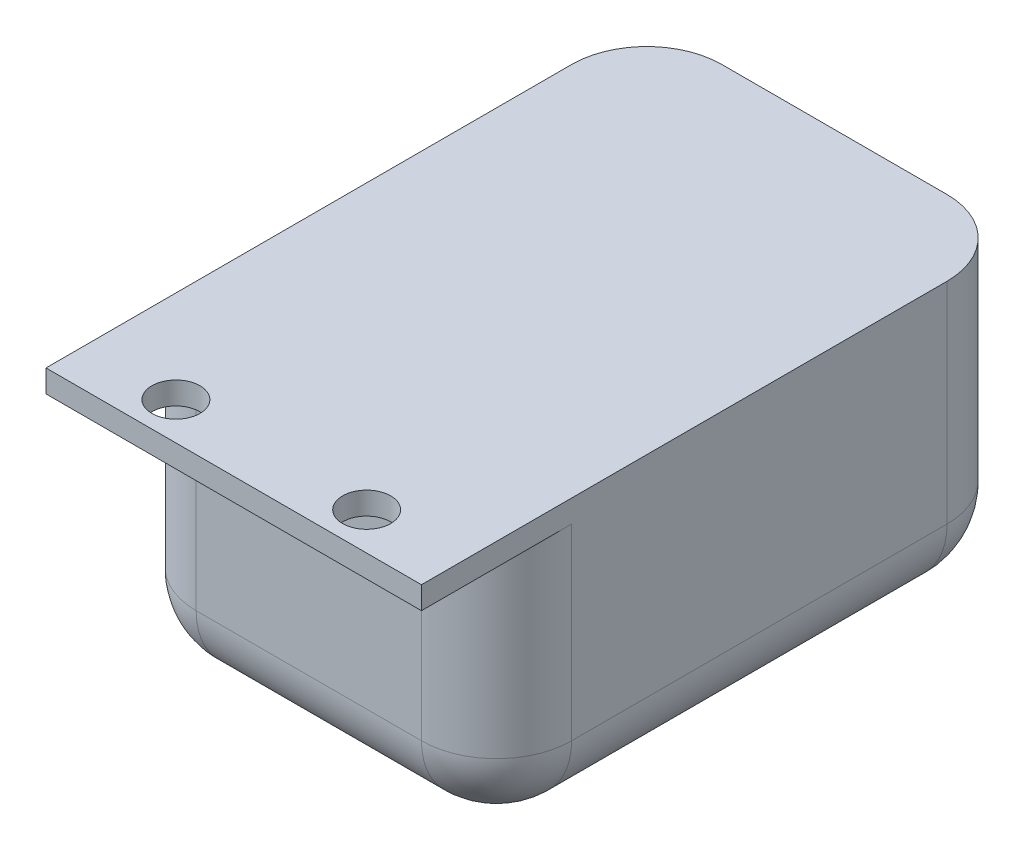
ISO-10303-21;
HEADER;
FILE_DESCRIPTION(('STEP AP214'),'2;1');
FILE_NAME('part.step','',(''),(''),'','','');
FILE_SCHEMA(('AUTOMOTIVE_DESIGN { 1 0 10303 214 1 1 1 1 }'));
ENDSEC;
DATA;
#1=APPLICATION_CONTEXT('core data for automotive mechanical design processes');
#2=APPLICATION_PROTOCOL_DEFINITION('international standard','automotive_design',2000,#1);
#3=PRODUCT_CONTEXT('',#1,'mechanical');
#4=PRODUCT('Part','Part','',(#3));
#5=PRODUCT_RELATED_PRODUCT_CATEGORY('part','',(#4));
#6=PRODUCT_DEFINITION_FORMATION('','',#4);
#7=PRODUCT_DEFINITION_CONTEXT('part definition',#1,'design');
#8=PRODUCT_DEFINITION('design','',#6,#7);
#9=PRODUCT_DEFINITION_SHAPE('','',#8);
#10=(LENGTH_UNIT() NAMED_UNIT(*) SI_UNIT(.MILLI.,.METRE.));
#11=(NAMED_UNIT(*) PLANE_ANGLE_UNIT() SI_UNIT($,.RADIAN.));
#12=(NAMED_UNIT(*) SI_UNIT($,.STERADIAN.) SOLID_ANGLE_UNIT());
#13=UNCERTAINTY_MEASURE_WITH_UNIT(LENGTH_MEASURE(1.E-05),#10,'distance_accuracy_value','');
#14=(GEOMETRIC_REPRESENTATION_CONTEXT(3) GLOBAL_UNCERTAINTY_ASSIGNED_CONTEXT((#13)) GLOBAL_UNIT_ASSIGNED_CONTEXT((#10,
#11,#12)) REPRESENTATION_CONTEXT('',''));
#15=CARTESIAN_POINT('',(0.,0.,0.));
#16=DIRECTION('',(0.,0.,1.));
#17=DIRECTION('',(1.,0.,0.));
#18=AXIS2_PLACEMENT_3D('',#15,#16,#17);
#19=CARTESIAN_POINT('',(50.,17.5,35.));
#20=DIRECTION('',(0.,0.,-1.));
#21=DIRECTION('',(-1.,0.,0.));
#22=AXIS2_PLACEMENT_3D('',#19,#20,#21);
#23=PLANE('',#22);
#24=DIRECTION('',(-1.,0.,0.));
#25=VECTOR('',#24,1.);
#26=CARTESIAN_POINT('',(50.,-7.5,35.));
#27=LINE('',#26,#25);
#28=CARTESIAN_POINT('',(10.,-7.5,35.));
#29=VERTEX_POINT('',#28);
#30=CARTESIAN_POINT('',(40.,-7.5,35.));
#31=VERTEX_POINT('',#30);
#32=EDGE_CURVE('E282',#29,#31,#27,.F.);
#33=ORIENTED_EDGE('',*,*,#32,.T.);
#34=DIRECTION('',(0.,-1.,0.));
#35=VECTOR('',#34,1.);
#36=CARTESIAN_POINT('',(40.,17.5,35.));
#37=LINE('',#36,#35);
#38=CARTESIAN_POINT('',(40.,17.5,35.));
#39=VERTEX_POINT('',#38);
#40=EDGE_CURVE('E284',#31,#39,#37,.F.);
#41=ORIENTED_EDGE('',*,*,#40,.T.);
#42=DIRECTION('',(1.,0.,0.));
#43=VECTOR('',#42,1.);
#44=CARTESIAN_POINT('',(50.,17.5,35.));
#45=LINE('',#44,#43);
#46=CARTESIAN_POINT('',(10.,17.5,35.));
#47=VERTEX_POINT('',#46);
#48=EDGE_CURVE('E207',#47,#39,#45,.T.);
#49=ORIENTED_EDGE('',*,*,#48,.F.);
#50=DIRECTION('',(0.,-1.,0.));
#51=VECTOR('',#50,1.);
#52=CARTESIAN_POINT('',(10.,17.5,35.));
#53=LINE('',#52,#51);
#54=EDGE_CURVE('E280',#47,#29,#53,.T.);
#55=ORIENTED_EDGE('',*,*,#54,.T.);
#56=EDGE_LOOP('',(#33,#41,#49,#55));
#57=FACE_BOUND('',#56,.T.);
#58=ADVANCED_FACE('F35',(#57),#23,.F.);
#59=CARTESIAN_POINT('',(50.,-14.5,35.));
#60=DIRECTION('',(0.,1.,0.));
#61=DIRECTION('',(0.,0.,1.));
#62=AXIS2_PLACEMENT_3D('',#59,#60,#61);
#63=PLANE('',#62);
#64=DIRECTION('',(-1.,0.,0.));
#65=VECTOR('',#64,1.);
#66=CARTESIAN_POINT('',(3.,-14.5,-22.));
#67=LINE('',#66,#65);
#68=CARTESIAN_POINT('',(37.,-14.5,-22.));
#69=VERTEX_POINT('',#68);
#70=CARTESIAN_POINT('',(13.,-14.5,-22.));
#71=VERTEX_POINT('',#70);
#72=EDGE_CURVE('E59',#69,#71,#67,.T.);
#73=ORIENTED_EDGE('',*,*,#72,.T.);
#74=DIRECTION('',(0.,0.,-1.));
#75=VECTOR('',#74,1.);
#76=CARTESIAN_POINT('',(13.,-14.5,32.));
#77=LINE('',#76,#75);
#78=CARTESIAN_POINT('',(13.,-14.5,22.));
#79=VERTEX_POINT('',#78);
#80=EDGE_CURVE('E11',#71,#79,#77,.F.);
#81=ORIENTED_EDGE('',*,*,#80,.T.);
#82=DIRECTION('',(-1.,0.,0.));
#83=VECTOR('',#82,1.);
#84=CARTESIAN_POINT('',(47.,-14.5,22.));
#85=LINE('',#84,#83);
#86=CARTESIAN_POINT('',(37.,-14.5,22.));
#87=VERTEX_POINT('',#86);
#88=EDGE_CURVE('E44',#79,#87,#85,.F.);
#89=ORIENTED_EDGE('',*,*,#88,.T.);
#90=DIRECTION('',(0.,0.,-1.));
#91=VECTOR('',#90,1.);
#92=CARTESIAN_POINT('',(37.,-14.5,35.));
#93=LINE('',#92,#91);
#94=EDGE_CURVE('E360',#87,#69,#93,.T.);
#95=ORIENTED_EDGE('',*,*,#94,.T.);
#96=EDGE_LOOP('',(#73,#81,#89,#95));
#97=FACE_BOUND('',#96,.T.);
#98=CARTESIAN_POINT('',(25.,-14.5,0.));
#99=DIRECTION('',(0.,1.,0.));
#100=DIRECTION('',(0.,0.,1.));
#101=AXIS2_PLACEMENT_3D('',#98,#99,#100);
#102=CIRCLE('',#101,4.5);
#103=CARTESIAN_POINT('',(25.,-14.5,4.5));
#104=VERTEX_POINT('',#103);
#105=EDGE_CURVE('E213',#104,#104,#102,.F.);
#106=ORIENTED_EDGE('',*,*,#105,.T.);
#107=EDGE_LOOP('',(#106));
#108=FACE_BOUND('',#107,.T.);
#109=ADVANCED_FACE('F435',(#97,#108),#63,.T.);
#110=CARTESIAN_POINT('',(47.,0.,0.));
#111=DIRECTION('',(1.,0.,0.));
#112=DIRECTION('',(0.,0.,-1.));
#113=AXIS2_PLACEMENT_3D('',#110,#111,#112);
#114=PLANE('',#113);
#115=DIRECTION('',(0.,0.,1.));
#116=VECTOR('',#115,1.);
#117=CARTESIAN_POINT('',(47.,17.5,35.));
#118=LINE('',#117,#116);
#119=CARTESIAN_POINT('',(47.,17.5,-22.));
#120=VERTEX_POINT('',#119);
#121=CARTESIAN_POINT('',(47.,17.5,22.));
#122=VERTEX_POINT('',#121);
#123=EDGE_CURVE('E242',#120,#122,#118,.T.);
#124=ORIENTED_EDGE('',*,*,#123,.F.);
#125=DIRECTION('',(0.,1.,0.));
#126=VECTOR('',#125,1.);
#127=CARTESIAN_POINT('',(47.,0.,-22.));
#128=LINE('',#127,#126);
#129=CARTESIAN_POINT('',(47.,-4.5,-22.));
#130=VERTEX_POINT('',#129);
#131=EDGE_CURVE('E352',#120,#130,#128,.F.);
#132=ORIENTED_EDGE('',*,*,#131,.T.);
#133=DIRECTION('',(0.,0.,-1.));
#134=VECTOR('',#133,1.);
#135=CARTESIAN_POINT('',(47.,-4.5,0.));
#136=LINE('',#135,#134);
#137=CARTESIAN_POINT('',(47.,-4.5,22.));
#138=VERTEX_POINT('',#137);
#139=EDGE_CURVE('E348',#130,#138,#136,.F.);
#140=ORIENTED_EDGE('',*,*,#139,.T.);
#141=DIRECTION('',(0.,-1.,0.));
#142=VECTOR('',#141,1.);
#143=CARTESIAN_POINT('',(47.,0.,22.));
#144=LINE('',#143,#142);
#145=EDGE_CURVE('E350',#138,#122,#144,.F.);
#146=ORIENTED_EDGE('',*,*,#145,.T.);
#147=EDGE_LOOP('',(#124,#132,#140,#146));
#148=FACE_BOUND('',#147,.T.);
#149=ADVANCED_FACE('F408',(#148),#114,.F.);
#150=CARTESIAN_POINT('',(3.,0.,0.));
#151=DIRECTION('',(1.,0.,0.));
#152=DIRECTION('',(0.,0.,-1.));
#153=AXIS2_PLACEMENT_3D('',#150,#151,#152);
#154=PLANE('',#153);
#155=DIRECTION('',(0.,0.,-1.));
#156=VECTOR('',#155,1.);
#157=CARTESIAN_POINT('',(3.,-4.5,-32.));
#158=LINE('',#157,#156);
#159=CARTESIAN_POINT('',(3.,-4.5,22.));
#160=VERTEX_POINT('',#159);
#161=CARTESIAN_POINT('',(3.,-4.5,-22.));
#162=VERTEX_POINT('',#161);
#163=EDGE_CURVE('E290',#160,#162,#158,.T.);
#164=ORIENTED_EDGE('',*,*,#163,.T.);
#165=DIRECTION('',(0.,1.,0.));
#166=VECTOR('',#165,1.);
#167=CARTESIAN_POINT('',(3.,17.5,-22.));
#168=LINE('',#167,#166);
#169=CARTESIAN_POINT('',(3.,17.5,-22.));
#170=VERTEX_POINT('',#169);
#171=EDGE_CURVE('E331',#162,#170,#168,.T.);
#172=ORIENTED_EDGE('',*,*,#171,.T.);
#173=DIRECTION('',(0.,0.,1.));
#174=VECTOR('',#173,1.);
#175=CARTESIAN_POINT('',(3.,17.5,35.));
#176=LINE('',#175,#174);
#177=CARTESIAN_POINT('',(3.,17.5,22.));
#178=VERTEX_POINT('',#177);
#179=EDGE_CURVE('E234',#170,#178,#176,.T.);
#180=ORIENTED_EDGE('',*,*,#179,.T.);
#181=DIRECTION('',(0.,-1.,0.));
#182=VECTOR('',#181,1.);
#183=CARTESIAN_POINT('',(3.,-14.5,22.));
#184=LINE('',#183,#182);
#185=EDGE_CURVE('E329',#178,#160,#184,.T.);
#186=ORIENTED_EDGE('',*,*,#185,.T.);
#187=EDGE_LOOP('',(#164,#172,#180,#186));
#188=FACE_BOUND('',#187,.T.);
#189=ADVANCED_FACE('F450',(#188),#154,.T.);
#190=CARTESIAN_POINT('',(50.,17.5,32.));
#191=DIRECTION('',(0.,0.,-1.));
#192=DIRECTION('',(-1.,0.,0.));
#193=AXIS2_PLACEMENT_3D('',#190,#191,#192);
#194=PLANE('',#193);
#195=DIRECTION('',(-1.,0.,0.));
#196=VECTOR('',#195,1.);
#197=CARTESIAN_POINT('',(3.,-4.5,32.));
#198=LINE('',#197,#196);
#199=CARTESIAN_POINT('',(37.,-4.5,32.));
#200=VERTEX_POINT('',#199);
#201=CARTESIAN_POINT('',(13.,-4.5,32.));
#202=VERTEX_POINT('',#201);
#203=EDGE_CURVE('E354',#200,#202,#198,.T.);
#204=ORIENTED_EDGE('',*,*,#203,.T.);
#205=DIRECTION('',(0.,-1.,0.));
#206=VECTOR('',#205,1.);
#207=CARTESIAN_POINT('',(13.,17.5,32.));
#208=LINE('',#207,#206);
#209=CARTESIAN_POINT('',(13.,17.5,32.));
#210=VERTEX_POINT('',#209);
#211=EDGE_CURVE('E358',#202,#210,#208,.F.);
#212=ORIENTED_EDGE('',*,*,#211,.T.);
#213=DIRECTION('',(-1.,0.,0.));
#214=VECTOR('',#213,1.);
#215=CARTESIAN_POINT('',(50.,17.5,32.));
#216=LINE('',#215,#214);
#217=CARTESIAN_POINT('',(37.,17.5,32.));
#218=VERTEX_POINT('',#217);
#219=EDGE_CURVE('E239',#218,#210,#216,.T.);
#220=ORIENTED_EDGE('',*,*,#219,.F.);
#221=DIRECTION('',(0.,-1.,0.));
#222=VECTOR('',#221,1.);
#223=CARTESIAN_POINT('',(37.,17.5,32.));
#224=LINE('',#223,#222);
#225=EDGE_CURVE('E356',#218,#200,#224,.T.);
#226=ORIENTED_EDGE('',*,*,#225,.T.);
#227=EDGE_LOOP('',(#204,#212,#220,#226));
#228=FACE_BOUND('',#227,.T.);
#229=ADVANCED_FACE('F443',(#228),#194,.T.);
#230=CARTESIAN_POINT('',(50.,17.5,-32.));
#231=DIRECTION('',(0.,0.,1.));
#232=DIRECTION('',(1.,0.,0.));
#233=AXIS2_PLACEMENT_3D('',#230,#231,#232);
#234=PLANE('',#233);
#235=DIRECTION('',(-1.,0.,0.));
#236=VECTOR('',#235,1.);
#237=CARTESIAN_POINT('',(50.,17.5,-32.));
#238=LINE('',#237,#236);
#239=CARTESIAN_POINT('',(37.,17.5,-32.));
#240=VERTEX_POINT('',#239);
#241=CARTESIAN_POINT('',(13.,17.5,-32.));
#242=VERTEX_POINT('',#241);
#243=EDGE_CURVE('E235',#240,#242,#238,.T.);
#244=ORIENTED_EDGE('',*,*,#243,.T.);
#245=DIRECTION('',(0.,1.,0.));
#246=VECTOR('',#245,1.);
#247=CARTESIAN_POINT('',(13.,-14.5,-32.));
#248=LINE('',#247,#246);
#249=CARTESIAN_POINT('',(13.,-4.5,-32.));
#250=VERTEX_POINT('',#249);
#251=EDGE_CURVE('E346',#242,#250,#248,.F.);
#252=ORIENTED_EDGE('',*,*,#251,.T.);
#253=DIRECTION('',(-1.,0.,0.));
#254=VECTOR('',#253,1.);
#255=CARTESIAN_POINT('',(47.,-4.5,-32.));
#256=LINE('',#255,#254);
#257=CARTESIAN_POINT('',(37.,-4.5,-32.));
#258=VERTEX_POINT('',#257);
#259=EDGE_CURVE('E342',#250,#258,#256,.F.);
#260=ORIENTED_EDGE('',*,*,#259,.T.);
#261=DIRECTION('',(0.,1.,0.));
#262=VECTOR('',#261,1.);
#263=CARTESIAN_POINT('',(37.,17.5,-32.));
#264=LINE('',#263,#262);
#265=EDGE_CURVE('E344',#258,#240,#264,.T.);
#266=ORIENTED_EDGE('',*,*,#265,.T.);
#267=EDGE_LOOP('',(#244,#252,#260,#266));
#268=FACE_BOUND('',#267,.T.);
#269=ADVANCED_FACE('F455',(#268),#234,.T.);
#270=CARTESIAN_POINT('',(0.,17.5,0.));
#271=DIRECTION('',(0.,-1.,0.));
#272=DIRECTION('',(0.,0.,-1.));
#273=AXIS2_PLACEMENT_3D('',#270,#271,#272);
#274=PLANE('',#273);
#275=ORIENTED_EDGE('',*,*,#179,.F.);
#276=CARTESIAN_POINT('',(13.,17.5,-22.));
#277=DIRECTION('',(0.,-1.,0.));
#278=DIRECTION('',(0.,0.,-1.));
#279=AXIS2_PLACEMENT_3D('',#276,#277,#278);
#280=CIRCLE('',#279,10.);
#281=EDGE_CURVE('E340',#170,#242,#280,.T.);
#282=ORIENTED_EDGE('',*,*,#281,.T.);
#283=ORIENTED_EDGE('',*,*,#243,.F.);
#284=CARTESIAN_POINT('',(37.,17.5,-22.));
#285=DIRECTION('',(0.,-1.,0.));
#286=DIRECTION('',(0.,0.,-1.));
#287=AXIS2_PLACEMENT_3D('',#284,#285,#286);
#288=CIRCLE('',#287,10.);
#289=EDGE_CURVE('E338',#240,#120,#288,.T.);
#290=ORIENTED_EDGE('',*,*,#289,.T.);
#291=ORIENTED_EDGE('',*,*,#123,.T.);
#292=CARTESIAN_POINT('',(37.,17.5,22.));
#293=DIRECTION('',(0.,-1.,0.));
#294=DIRECTION('',(0.,0.,-1.));
#295=AXIS2_PLACEMENT_3D('',#292,#293,#294);
#296=CIRCLE('',#295,10.);
#297=EDGE_CURVE('E334',#122,#218,#296,.T.);
#298=ORIENTED_EDGE('',*,*,#297,.T.);
#299=ORIENTED_EDGE('',*,*,#219,.T.);
#300=CARTESIAN_POINT('',(13.,17.5,22.));
#301=DIRECTION('',(0.,-1.,0.));
#302=DIRECTION('',(0.,0.,-1.));
#303=AXIS2_PLACEMENT_3D('',#300,#301,#302);
#304=CIRCLE('',#303,10.);
#305=EDGE_CURVE('E336',#210,#178,#304,.T.);
#306=ORIENTED_EDGE('',*,*,#305,.T.);
#307=EDGE_LOOP('',(#275,#282,#283,#290,#291,#298,#299,#306));
#308=FACE_BOUND('',#307,.T.);
#309=ADVANCED_FACE('F412',(#308),#274,.T.);
#310=CARTESIAN_POINT('',(25.,20.501,0.));
#311=DIRECTION('',(0.,-1.,0.));
#312=DIRECTION('',(0.,0.,-1.));
#313=AXIS2_PLACEMENT_3D('',#310,#311,#312);
#314=CYLINDRICAL_SURFACE('',#313,4.5);
#315=ORIENTED_EDGE('',*,*,#105,.F.);
#316=EDGE_LOOP('',(#315));
#317=FACE_BOUND('',#316,.T.);
#318=CARTESIAN_POINT('',(25.,-23.5,0.));
#319=DIRECTION('',(0.,-1.,0.));
#320=DIRECTION('',(0.,0.,-1.));
#321=AXIS2_PLACEMENT_3D('',#318,#319,#320);
#322=CIRCLE('',#321,4.5);
#323=CARTESIAN_POINT('',(25.,-23.5,-4.5));
#324=VERTEX_POINT('',#323);
#325=EDGE_CURVE('E216',#324,#324,#322,.T.);
#326=ORIENTED_EDGE('',*,*,#325,.T.);
#327=EDGE_LOOP('',(#326));
#328=FACE_BOUND('',#327,.T.);
#329=ADVANCED_FACE('F462',(#317,#328),#314,.F.);
#330=CARTESIAN_POINT('',(50.,17.5,-35.));
#331=DIRECTION('',(0.,0.,1.));
#332=DIRECTION('',(1.,0.,0.));
#333=AXIS2_PLACEMENT_3D('',#330,#331,#332);
#334=PLANE('',#333);
#335=DIRECTION('',(-1.,0.,0.));
#336=VECTOR('',#335,1.);
#337=CARTESIAN_POINT('',(0.,20.5,-35.));
#338=LINE('',#337,#336);
#339=CARTESIAN_POINT('',(40.,20.5,-35.));
#340=VERTEX_POINT('',#339);
#341=CARTESIAN_POINT('',(10.,20.5,-35.));
#342=VERTEX_POINT('',#341);
#343=EDGE_CURVE('E229',#340,#342,#338,.T.);
#344=ORIENTED_EDGE('',*,*,#343,.F.);
#345=DIRECTION('',(0.,1.,0.));
#346=VECTOR('',#345,1.);
#347=CARTESIAN_POINT('',(40.,-17.5,-35.));
#348=LINE('',#347,#346);
#349=CARTESIAN_POINT('',(40.,-7.5,-35.));
#350=VERTEX_POINT('',#349);
#351=EDGE_CURVE('E264',#340,#350,#348,.F.);
#352=ORIENTED_EDGE('',*,*,#351,.T.);
#353=DIRECTION('',(-1.,0.,0.));
#354=VECTOR('',#353,1.);
#355=CARTESIAN_POINT('',(50.,-7.5,-35.));
#356=LINE('',#355,#354);
#357=CARTESIAN_POINT('',(10.,-7.5,-35.));
#358=VERTEX_POINT('',#357);
#359=EDGE_CURVE('E260',#350,#358,#356,.T.);
#360=ORIENTED_EDGE('',*,*,#359,.T.);
#361=DIRECTION('',(0.,1.,0.));
#362=VECTOR('',#361,1.);
#363=CARTESIAN_POINT('',(10.,17.5,-35.));
#364=LINE('',#363,#362);
#365=EDGE_CURVE('E262',#358,#342,#364,.T.);
#366=ORIENTED_EDGE('',*,*,#365,.T.);
#367=EDGE_LOOP('',(#344,#352,#360,#366));
#368=FACE_BOUND('',#367,.T.);
#369=ADVANCED_FACE('F478',(#368),#334,.F.);
#370=CARTESIAN_POINT('',(50.,-17.5,35.));
#371=DIRECTION('',(0.,1.,0.));
#372=DIRECTION('',(0.,0.,1.));
#373=AXIS2_PLACEMENT_3D('',#370,#371,#372);
#374=PLANE('',#373);
#375=DIRECTION('',(-1.,0.,0.));
#376=VECTOR('',#375,1.);
#377=CARTESIAN_POINT('',(50.,-17.5,25.));
#378=LINE('',#377,#376);
#379=CARTESIAN_POINT('',(40.,-17.5,25.));
#380=VERTEX_POINT('',#379);
#381=CARTESIAN_POINT('',(10.,-17.5,25.));
#382=VERTEX_POINT('',#381);
#383=EDGE_CURVE('E271',#380,#382,#378,.T.);
#384=ORIENTED_EDGE('',*,*,#383,.T.);
#385=DIRECTION('',(0.,0.,-1.));
#386=VECTOR('',#385,1.);
#387=CARTESIAN_POINT('',(10.,-17.5,35.));
#388=LINE('',#387,#386);
#389=CARTESIAN_POINT('',(10.,-17.5,-25.));
#390=VERTEX_POINT('',#389);
#391=EDGE_CURVE('E277',#382,#390,#388,.T.);
#392=ORIENTED_EDGE('',*,*,#391,.T.);
#393=DIRECTION('',(-1.,0.,0.));
#394=VECTOR('',#393,1.);
#395=CARTESIAN_POINT('',(50.,-17.5,-25.));
#396=LINE('',#395,#394);
#397=CARTESIAN_POINT('',(40.,-17.5,-25.));
#398=VERTEX_POINT('',#397);
#399=EDGE_CURVE('E275',#390,#398,#396,.F.);
#400=ORIENTED_EDGE('',*,*,#399,.T.);
#401=DIRECTION('',(0.,0.,-1.));
#402=VECTOR('',#401,1.);
#403=CARTESIAN_POINT('',(40.,-17.5,35.));
#404=LINE('',#403,#402);
#405=EDGE_CURVE('E273',#398,#380,#404,.F.);
#406=ORIENTED_EDGE('',*,*,#405,.T.);
#407=EDGE_LOOP('',(#384,#392,#400,#406));
#408=FACE_BOUND('',#407,.T.);
#409=CARTESIAN_POINT('',(25.,-17.5,0.));
#410=DIRECTION('',(0.,1.,0.));
#411=DIRECTION('',(0.,0.,1.));
#412=AXIS2_PLACEMENT_3D('',#409,#410,#411);
#413=CIRCLE('',#412,6.5);
#414=CARTESIAN_POINT('',(25.,-17.5,6.5));
#415=VERTEX_POINT('',#414);
#416=EDGE_CURVE('E238',#415,#415,#413,.F.);
#417=ORIENTED_EDGE('',*,*,#416,.F.);
#418=EDGE_LOOP('',(#417));
#419=FACE_BOUND('',#418,.T.);
#420=ADVANCED_FACE('F476',(#408,#419),#374,.F.);
#421=CARTESIAN_POINT('',(50.,0.,0.));
#422=DIRECTION('',(1.,0.,0.));
#423=DIRECTION('',(0.,0.,-1.));
#424=AXIS2_PLACEMENT_3D('',#421,#422,#423);
#425=PLANE('',#424);
#426=DIRECTION('',(0.,0.,-1.));
#427=VECTOR('',#426,1.);
#428=CARTESIAN_POINT('',(50.,-7.5,-35.));
#429=LINE('',#428,#427);
#430=CARTESIAN_POINT('',(50.,-7.5,25.));
#431=VERTEX_POINT('',#430);
#432=CARTESIAN_POINT('',(50.,-7.5,-25.));
#433=VERTEX_POINT('',#432);
#434=EDGE_CURVE('E251',#431,#433,#429,.T.);
#435=ORIENTED_EDGE('',*,*,#434,.T.);
#436=DIRECTION('',(0.,1.,0.));
#437=VECTOR('',#436,1.);
#438=CARTESIAN_POINT('',(50.,20.5,-25.));
#439=LINE('',#438,#437);
#440=CARTESIAN_POINT('',(50.,20.5,-25.));
#441=VERTEX_POINT('',#440);
#442=EDGE_CURVE('E253',#433,#441,#439,.T.);
#443=ORIENTED_EDGE('',*,*,#442,.T.);
#444=DIRECTION('',(0.,0.,-1.));
#445=VECTOR('',#444,1.);
#446=CARTESIAN_POINT('',(50.,20.5,-35.));
#447=LINE('',#446,#445);
#448=CARTESIAN_POINT('',(50.,20.5,45.));
#449=VERTEX_POINT('',#448);
#450=EDGE_CURVE('E226',#449,#441,#447,.T.);
#451=ORIENTED_EDGE('',*,*,#450,.F.);
#452=DIRECTION('',(0.,1.,0.));
#453=VECTOR('',#452,1.);
#454=CARTESIAN_POINT('',(50.,20.5,45.));
#455=LINE('',#454,#453);
#456=CARTESIAN_POINT('',(50.,17.5,45.));
#457=VERTEX_POINT('',#456);
#458=EDGE_CURVE('E197',#457,#449,#455,.T.);
#459=ORIENTED_EDGE('',*,*,#458,.F.);
#460=DIRECTION('',(0.,0.,-1.));
#461=VECTOR('',#460,1.);
#462=CARTESIAN_POINT('',(50.,17.5,45.));
#463=LINE('',#462,#461);
#464=CARTESIAN_POINT('',(50.,17.5,25.));
#465=VERTEX_POINT('',#464);
#466=EDGE_CURVE('E193',#457,#465,#463,.T.);
#467=ORIENTED_EDGE('',*,*,#466,.T.);
#468=DIRECTION('',(0.,-1.,0.));
#469=VECTOR('',#468,1.);
#470=CARTESIAN_POINT('',(50.,-17.5,25.));
#471=LINE('',#470,#469);
#472=EDGE_CURVE('E249',#465,#431,#471,.T.);
#473=ORIENTED_EDGE('',*,*,#472,.T.);
#474=EDGE_LOOP('',(#435,#443,#451,#459,#467,#473));
#475=FACE_BOUND('',#474,.T.);
#476=ADVANCED_FACE('F669',(#475),#425,.T.);
#477=CARTESIAN_POINT('',(0.,0.,0.));
#478=DIRECTION('',(1.,0.,0.));
#479=DIRECTION('',(0.,0.,-1.));
#480=AXIS2_PLACEMENT_3D('',#477,#478,#479);
#481=PLANE('',#480);
#482=DIRECTION('',(0.,0.,1.));
#483=VECTOR('',#482,1.);
#484=CARTESIAN_POINT('',(0.,20.5,35.));
#485=LINE('',#484,#483);
#486=CARTESIAN_POINT('',(0.,20.5,-25.));
#487=VERTEX_POINT('',#486);
#488=CARTESIAN_POINT('',(0.,20.5,45.));
#489=VERTEX_POINT('',#488);
#490=EDGE_CURVE('E232',#487,#489,#485,.T.);
#491=ORIENTED_EDGE('',*,*,#490,.F.);
#492=DIRECTION('',(0.,1.,0.));
#493=VECTOR('',#492,1.);
#494=CARTESIAN_POINT('',(0.,0.,-25.));
#495=LINE('',#494,#493);
#496=CARTESIAN_POINT('',(0.,-7.5,-25.));
#497=VERTEX_POINT('',#496);
#498=EDGE_CURVE('E269',#487,#497,#495,.F.);
#499=ORIENTED_EDGE('',*,*,#498,.T.);
#500=DIRECTION('',(0.,0.,-1.));
#501=VECTOR('',#500,1.);
#502=CARTESIAN_POINT('',(0.,-7.5,0.));
#503=LINE('',#502,#501);
#504=CARTESIAN_POINT('',(0.,-7.5,25.));
#505=VERTEX_POINT('',#504);
#506=EDGE_CURVE('E267',#497,#505,#503,.F.);
#507=ORIENTED_EDGE('',*,*,#506,.T.);
#508=DIRECTION('',(0.,-1.,0.));
#509=VECTOR('',#508,1.);
#510=CARTESIAN_POINT('',(0.,0.,25.));
#511=LINE('',#510,#509);
#512=CARTESIAN_POINT('',(0.,17.5,25.));
#513=VERTEX_POINT('',#512);
#514=EDGE_CURVE('E211',#505,#513,#511,.F.);
#515=ORIENTED_EDGE('',*,*,#514,.T.);
#516=DIRECTION('',(0.,0.,-1.));
#517=VECTOR('',#516,1.);
#518=CARTESIAN_POINT('',(0.,17.5,45.));
#519=LINE('',#518,#517);
#520=CARTESIAN_POINT('',(0.,17.5,45.));
#521=VERTEX_POINT('',#520);
#522=EDGE_CURVE('E190',#521,#513,#519,.T.);
#523=ORIENTED_EDGE('',*,*,#522,.F.);
#524=DIRECTION('',(0.,-1.,0.));
#525=VECTOR('',#524,1.);
#526=CARTESIAN_POINT('',(0.,17.5,45.));
#527=LINE('',#526,#525);
#528=EDGE_CURVE('E198',#489,#521,#527,.T.);
#529=ORIENTED_EDGE('',*,*,#528,.F.);
#530=EDGE_LOOP('',(#491,#499,#507,#515,#523,#529));
#531=FACE_BOUND('',#530,.T.);
#532=ADVANCED_FACE('F209',(#531),#481,.F.);
#533=CARTESIAN_POINT('',(0.,20.5,0.));
#534=DIRECTION('',(0.,-1.,0.));
#535=DIRECTION('',(0.,0.,-1.));
#536=AXIS2_PLACEMENT_3D('',#533,#534,#535);
#537=PLANE('',#536);
#538=CARTESIAN_POINT('',(37.7,20.5,40.));
#539=DIRECTION('',(0.,-1.,0.));
#540=DIRECTION('',(1.,0.,0.));
#541=AXIS2_PLACEMENT_3D('',#538,#539,#540);
#542=CIRCLE('',#541,3.2);
#543=CARTESIAN_POINT('',(40.9,20.5,40.));
#544=VERTEX_POINT('',#543);
#545=EDGE_CURVE('E810',#544,#544,#542,.T.);
#546=ORIENTED_EDGE('',*,*,#545,.T.);
#547=EDGE_LOOP('',(#546));
#548=FACE_BOUND('',#547,.T.);
#549=CARTESIAN_POINT('',(12.3,20.5,40.));
#550=DIRECTION('',(0.,-1.,0.));
#551=DIRECTION('',(1.,0.,0.));
#552=AXIS2_PLACEMENT_3D('',#549,#550,#551);
#553=CIRCLE('',#552,3.2);
#554=CARTESIAN_POINT('',(15.5,20.5,40.));
#555=VERTEX_POINT('',#554);
#556=EDGE_CURVE('E802',#555,#555,#553,.T.);
#557=ORIENTED_EDGE('',*,*,#556,.T.);
#558=EDGE_LOOP('',(#557));
#559=FACE_BOUND('',#558,.T.);
#560=ORIENTED_EDGE('',*,*,#450,.T.);
#561=CARTESIAN_POINT('',(40.,20.5,-25.));
#562=DIRECTION('',(0.,-1.,0.));
#563=DIRECTION('',(0.,0.,-1.));
#564=AXIS2_PLACEMENT_3D('',#561,#562,#563);
#565=CIRCLE('',#564,10.);
#566=EDGE_CURVE('E258',#441,#340,#565,.F.);
#567=ORIENTED_EDGE('',*,*,#566,.T.);
#568=ORIENTED_EDGE('',*,*,#343,.T.);
#569=CARTESIAN_POINT('',(10.,20.5,-25.));
#570=DIRECTION('',(0.,-1.,0.));
#571=DIRECTION('',(0.,0.,-1.));
#572=AXIS2_PLACEMENT_3D('',#569,#570,#571);
#573=CIRCLE('',#572,10.);
#574=EDGE_CURVE('E256',#342,#487,#573,.F.);
#575=ORIENTED_EDGE('',*,*,#574,.T.);
#576=ORIENTED_EDGE('',*,*,#490,.T.);
#577=DIRECTION('',(-1.,0.,0.));
#578=VECTOR('',#577,1.);
#579=CARTESIAN_POINT('',(0.,20.5,45.));
#580=LINE('',#579,#578);
#581=EDGE_CURVE('E204',#449,#489,#580,.T.);
#582=ORIENTED_EDGE('',*,*,#581,.F.);
#583=EDGE_LOOP('',(#560,#567,#568,#575,#576,#582));
#584=FACE_BOUND('',#583,.T.);
#585=ADVANCED_FACE('F652',(#548,#559,#584),#537,.F.);
#586=CARTESIAN_POINT('',(25.,-23.5,0.));
#587=DIRECTION('',(0.,1.,0.));
#588=DIRECTION('',(0.,0.,1.));
#589=AXIS2_PLACEMENT_3D('',#586,#587,#588);
#590=CYLINDRICAL_SURFACE('',#589,6.5);
#591=CARTESIAN_POINT('',(25.,-23.5,0.));
#592=DIRECTION('',(0.,-1.,0.));
#593=DIRECTION('',(0.,0.,-1.));
#594=AXIS2_PLACEMENT_3D('',#591,#592,#593);
#595=CIRCLE('',#594,6.5);
#596=CARTESIAN_POINT('',(25.,-23.5,-6.5));
#597=VERTEX_POINT('',#596);
#598=EDGE_CURVE('E223',#597,#597,#595,.T.);
#599=ORIENTED_EDGE('',*,*,#598,.F.);
#600=EDGE_LOOP('',(#599));
#601=FACE_BOUND('',#600,.T.);
#602=ORIENTED_EDGE('',*,*,#416,.T.);
#603=EDGE_LOOP('',(#602));
#604=FACE_BOUND('',#603,.T.);
#605=ADVANCED_FACE('F643',(#601,#604),#590,.T.);
#606=CARTESIAN_POINT('',(25.,-23.5,0.));
#607=DIRECTION('',(0.,-1.,0.));
#608=DIRECTION('',(0.,0.,-1.));
#609=AXIS2_PLACEMENT_3D('',#606,#607,#608);
#610=PLANE('',#609);
#611=ORIENTED_EDGE('',*,*,#325,.F.);
#612=EDGE_LOOP('',(#611));
#613=FACE_BOUND('',#612,.T.);
#614=ORIENTED_EDGE('',*,*,#598,.T.);
#615=EDGE_LOOP('',(#614));
#616=FACE_BOUND('',#615,.T.);
#617=ADVANCED_FACE('F633',(#613,#616),#610,.T.);
#618=CARTESIAN_POINT('',(50.,17.5,45.));
#619=DIRECTION('',(0.,1.,0.));
#620=DIRECTION('',(-1.,0.,0.));
#621=AXIS2_PLACEMENT_3D('',#618,#619,#620);
#622=PLANE('',#621);
#623=CARTESIAN_POINT('',(37.7,17.5,40.));
#624=DIRECTION('',(0.,-1.,0.));
#625=DIRECTION('',(1.,0.,0.));
#626=AXIS2_PLACEMENT_3D('',#623,#624,#625);
#627=CIRCLE('',#626,3.2);
#628=CARTESIAN_POINT('',(40.9,17.5,40.));
#629=VERTEX_POINT('',#628);
#630=EDGE_CURVE('E327',#629,#629,#627,.T.);
#631=ORIENTED_EDGE('',*,*,#630,.F.);
#632=EDGE_LOOP('',(#631));
#633=FACE_BOUND('',#632,.T.);
#634=CARTESIAN_POINT('',(12.3,17.5,40.));
#635=DIRECTION('',(0.,-1.,0.));
#636=DIRECTION('',(1.,0.,0.));
#637=AXIS2_PLACEMENT_3D('',#634,#635,#636);
#638=CIRCLE('',#637,3.2);
#639=CARTESIAN_POINT('',(15.5,17.5,40.));
#640=VERTEX_POINT('',#639);
#641=EDGE_CURVE('E804',#640,#640,#638,.T.);
#642=ORIENTED_EDGE('',*,*,#641,.F.);
#643=EDGE_LOOP('',(#642));
#644=FACE_BOUND('',#643,.T.);
#645=ORIENTED_EDGE('',*,*,#522,.T.);
#646=CARTESIAN_POINT('',(10.,17.5,25.));
#647=DIRECTION('',(0.,1.,0.));
#648=DIRECTION('',(-1.,0.,0.));
#649=AXIS2_PLACEMENT_3D('',#646,#647,#648);
#650=CIRCLE('',#649,10.);
#651=EDGE_CURVE('E288',#513,#47,#650,.T.);
#652=ORIENTED_EDGE('',*,*,#651,.T.);
#653=ORIENTED_EDGE('',*,*,#48,.T.);
#654=CARTESIAN_POINT('',(40.,17.5,25.));
#655=DIRECTION('',(0.,1.,0.));
#656=DIRECTION('',(-1.,0.,0.));
#657=AXIS2_PLACEMENT_3D('',#654,#655,#656);
#658=CIRCLE('',#657,10.);
#659=EDGE_CURVE('E286',#39,#465,#658,.T.);
#660=ORIENTED_EDGE('',*,*,#659,.T.);
#661=ORIENTED_EDGE('',*,*,#466,.F.);
#662=DIRECTION('',(1.,0.,0.));
#663=VECTOR('',#662,1.);
#664=CARTESIAN_POINT('',(50.,17.5,45.));
#665=LINE('',#664,#663);
#666=EDGE_CURVE('E186',#521,#457,#665,.T.);
#667=ORIENTED_EDGE('',*,*,#666,.F.);
#668=EDGE_LOOP('',(#645,#652,#653,#660,#661,#667));
#669=FACE_BOUND('',#668,.T.);
#670=ADVANCED_FACE('F188',(#633,#644,#669),#622,.F.);
#671=CARTESIAN_POINT('',(0.,0.,45.));
#672=DIRECTION('',(0.,0.,-1.));
#673=DIRECTION('',(-1.,0.,0.));
#674=AXIS2_PLACEMENT_3D('',#671,#672,#673);
#675=PLANE('',#674);
#676=ORIENTED_EDGE('',*,*,#528,.T.);
#677=ORIENTED_EDGE('',*,*,#666,.T.);
#678=ORIENTED_EDGE('',*,*,#458,.T.);
#679=ORIENTED_EDGE('',*,*,#581,.T.);
#680=EDGE_LOOP('',(#676,#677,#678,#679));
#681=FACE_BOUND('',#680,.T.);
#682=ADVANCED_FACE('F202',(#681),#675,.F.);
#683=CARTESIAN_POINT('',(12.3,20.5,40.));
#684=DIRECTION('',(0.,-1.,0.));
#685=DIRECTION('',(1.,0.,0.));
#686=AXIS2_PLACEMENT_3D('',#683,#684,#685);
#687=CYLINDRICAL_SURFACE('',#686,3.2);
#688=ORIENTED_EDGE('',*,*,#556,.F.);
#689=EDGE_LOOP('',(#688));
#690=FACE_BOUND('',#689,.T.);
#691=ORIENTED_EDGE('',*,*,#641,.T.);
#692=EDGE_LOOP('',(#691));
#693=FACE_BOUND('',#692,.T.);
#694=ADVANCED_FACE('F611',(#690,#693),#687,.F.);
#695=CARTESIAN_POINT('',(37.7,20.5,40.));
#696=DIRECTION('',(0.,-1.,0.));
#697=DIRECTION('',(1.,0.,0.));
#698=AXIS2_PLACEMENT_3D('',#695,#696,#697);
#699=CYLINDRICAL_SURFACE('',#698,3.2);
#700=ORIENTED_EDGE('',*,*,#545,.F.);
#701=EDGE_LOOP('',(#700));
#702=FACE_BOUND('',#701,.T.);
#703=ORIENTED_EDGE('',*,*,#630,.T.);
#704=EDGE_LOOP('',(#703));
#705=FACE_BOUND('',#704,.T.);
#706=ADVANCED_FACE('F528',(#702,#705),#699,.F.);
#707=CARTESIAN_POINT('',(10.,17.5,25.));
#708=DIRECTION('',(0.,-1.,0.));
#709=DIRECTION('',(0.,0.,-1.));
#710=AXIS2_PLACEMENT_3D('',#707,#708,#709);
#711=CYLINDRICAL_SURFACE('',#710,10.);
#712=CARTESIAN_POINT('',(10.,-7.5,25.));
#713=DIRECTION('',(0.,-1.,0.));
#714=DIRECTION('',(0.,0.,-1.));
#715=AXIS2_PLACEMENT_3D('',#712,#713,#714);
#716=CIRCLE('',#715,10.);
#717=EDGE_CURVE('E324',#29,#505,#716,.T.);
#718=ORIENTED_EDGE('',*,*,#717,.F.);
#719=ORIENTED_EDGE('',*,*,#54,.F.);
#720=ORIENTED_EDGE('',*,*,#651,.F.);
#721=ORIENTED_EDGE('',*,*,#514,.F.);
#722=EDGE_LOOP('',(#718,#719,#720,#721));
#723=FACE_BOUND('',#722,.T.);
#724=ADVANCED_FACE('F524',(#723),#711,.T.);
#725=CARTESIAN_POINT('',(10.,-7.5,25.));
#726=DIRECTION('',(0.,0.,1.));
#727=DIRECTION('',(1.,0.,0.));
#728=AXIS2_PLACEMENT_3D('',#725,#726,#727);
#729=SPHERICAL_SURFACE('',#728,10.);
#730=CARTESIAN_POINT('',(10.,-7.5,25.));
#731=DIRECTION('',(-1.,0.,0.));
#732=DIRECTION('',(0.,0.,1.));
#733=AXIS2_PLACEMENT_3D('',#730,#731,#732);
#734=CIRCLE('',#733,10.);
#735=EDGE_CURVE('E318',#29,#382,#734,.F.);
#736=ORIENTED_EDGE('',*,*,#735,.F.);
#737=ORIENTED_EDGE('',*,*,#717,.T.);
#738=CARTESIAN_POINT('',(10.,-7.5,25.));
#739=DIRECTION('',(0.,0.,1.));
#740=DIRECTION('',(1.,0.,0.));
#741=AXIS2_PLACEMENT_3D('',#738,#739,#740);
#742=CIRCLE('',#741,10.);
#743=EDGE_CURVE('E321',#382,#505,#742,.F.);
#744=ORIENTED_EDGE('',*,*,#743,.F.);
#745=EDGE_LOOP('',(#736,#737,#744));
#746=FACE_BOUND('',#745,.T.);
#747=ADVANCED_FACE('F520',(#746),#729,.T.);
#748=CARTESIAN_POINT('',(10.,17.5,-25.));
#749=DIRECTION('',(0.,1.,0.));
#750=DIRECTION('',(0.,0.,1.));
#751=AXIS2_PLACEMENT_3D('',#748,#749,#750);
#752=CYLINDRICAL_SURFACE('',#751,10.);
#753=ORIENTED_EDGE('',*,*,#574,.F.);
#754=ORIENTED_EDGE('',*,*,#365,.F.);
#755=CARTESIAN_POINT('',(10.,-7.5,-25.));
#756=DIRECTION('',(0.,-1.,0.));
#757=DIRECTION('',(0.,0.,-1.));
#758=AXIS2_PLACEMENT_3D('',#755,#756,#757);
#759=CIRCLE('',#758,10.);
#760=EDGE_CURVE('E315',#497,#358,#759,.T.);
#761=ORIENTED_EDGE('',*,*,#760,.F.);
#762=ORIENTED_EDGE('',*,*,#498,.F.);
#763=EDGE_LOOP('',(#753,#754,#761,#762));
#764=FACE_BOUND('',#763,.T.);
#765=ADVANCED_FACE('F516',(#764),#752,.T.);
#766=CARTESIAN_POINT('',(10.,-7.5,35.));
#767=DIRECTION('',(0.,0.,-1.));
#768=DIRECTION('',(-1.,0.,0.));
#769=AXIS2_PLACEMENT_3D('',#766,#767,#768);
#770=CYLINDRICAL_SURFACE('',#769,10.);
#771=ORIENTED_EDGE('',*,*,#743,.T.);
#772=ORIENTED_EDGE('',*,*,#506,.F.);
#773=CARTESIAN_POINT('',(10.,-7.5,-25.));
#774=DIRECTION('',(0.,0.,-1.));
#775=DIRECTION('',(-1.,0.,0.));
#776=AXIS2_PLACEMENT_3D('',#773,#774,#775);
#777=CIRCLE('',#776,10.);
#778=EDGE_CURVE('E312',#390,#497,#777,.T.);
#779=ORIENTED_EDGE('',*,*,#778,.F.);
#780=ORIENTED_EDGE('',*,*,#391,.F.);
#781=EDGE_LOOP('',(#771,#772,#779,#780));
#782=FACE_BOUND('',#781,.T.);
#783=ADVANCED_FACE('F512',(#782),#770,.T.);
#784=CARTESIAN_POINT('',(50.,-7.5,25.));
#785=DIRECTION('',(-1.,0.,0.));
#786=DIRECTION('',(0.,0.,1.));
#787=AXIS2_PLACEMENT_3D('',#784,#785,#786);
#788=CYLINDRICAL_SURFACE('',#787,10.);
#789=ORIENTED_EDGE('',*,*,#735,.T.);
#790=ORIENTED_EDGE('',*,*,#383,.F.);
#791=CARTESIAN_POINT('',(40.,-7.5,25.));
#792=DIRECTION('',(1.,0.,0.));
#793=DIRECTION('',(0.,0.,-1.));
#794=AXIS2_PLACEMENT_3D('',#791,#792,#793);
#795=CIRCLE('',#794,10.);
#796=EDGE_CURVE('E309',#31,#380,#795,.T.);
#797=ORIENTED_EDGE('',*,*,#796,.F.);
#798=ORIENTED_EDGE('',*,*,#32,.F.);
#799=EDGE_LOOP('',(#789,#790,#797,#798));
#800=FACE_BOUND('',#799,.T.);
#801=ADVANCED_FACE('F508',(#800),#788,.T.);
#802=CARTESIAN_POINT('',(40.,0.,25.));
#803=DIRECTION('',(0.,1.,0.));
#804=DIRECTION('',(0.,0.,1.));
#805=AXIS2_PLACEMENT_3D('',#802,#803,#804);
#806=CYLINDRICAL_SURFACE('',#805,10.);
#807=ORIENTED_EDGE('',*,*,#659,.F.);
#808=ORIENTED_EDGE('',*,*,#40,.F.);
#809=CARTESIAN_POINT('',(40.,-7.5,25.));
#810=DIRECTION('',(0.,-1.,0.));
#811=DIRECTION('',(0.,0.,-1.));
#812=AXIS2_PLACEMENT_3D('',#809,#810,#811);
#813=CIRCLE('',#812,10.);
#814=EDGE_CURVE('E306',#431,#31,#813,.T.);
#815=ORIENTED_EDGE('',*,*,#814,.F.);
#816=ORIENTED_EDGE('',*,*,#472,.F.);
#817=EDGE_LOOP('',(#807,#808,#815,#816));
#818=FACE_BOUND('',#817,.T.);
#819=ADVANCED_FACE('F504',(#818),#806,.T.);
#820=CARTESIAN_POINT('',(10.,-7.5,-25.));
#821=DIRECTION('',(0.,0.,1.));
#822=DIRECTION('',(1.,0.,0.));
#823=AXIS2_PLACEMENT_3D('',#820,#821,#822);
#824=SPHERICAL_SURFACE('',#823,10.);
#825=ORIENTED_EDGE('',*,*,#778,.T.);
#826=ORIENTED_EDGE('',*,*,#760,.T.);
#827=CARTESIAN_POINT('',(10.,-7.5,-25.));
#828=DIRECTION('',(-1.,0.,0.));
#829=DIRECTION('',(0.,0.,1.));
#830=AXIS2_PLACEMENT_3D('',#827,#828,#829);
#831=CIRCLE('',#830,10.);
#832=EDGE_CURVE('E303',#390,#358,#831,.F.);
#833=ORIENTED_EDGE('',*,*,#832,.F.);
#834=EDGE_LOOP('',(#825,#826,#833));
#835=FACE_BOUND('',#834,.T.);
#836=ADVANCED_FACE('F500',(#835),#824,.T.);
#837=CARTESIAN_POINT('',(40.,-7.5,25.));
#838=DIRECTION('',(0.,0.,1.));
#839=DIRECTION('',(1.,0.,0.));
#840=AXIS2_PLACEMENT_3D('',#837,#838,#839);
#841=SPHERICAL_SURFACE('',#840,10.);
#842=ORIENTED_EDGE('',*,*,#814,.T.);
#843=ORIENTED_EDGE('',*,*,#796,.T.);
#844=CARTESIAN_POINT('',(40.,-7.5,25.));
#845=DIRECTION('',(0.,0.,1.));
#846=DIRECTION('',(1.,0.,0.));
#847=AXIS2_PLACEMENT_3D('',#844,#845,#846);
#848=CIRCLE('',#847,10.);
#849=EDGE_CURVE('E300',#431,#380,#848,.F.);
#850=ORIENTED_EDGE('',*,*,#849,.F.);
#851=EDGE_LOOP('',(#842,#843,#850));
#852=FACE_BOUND('',#851,.T.);
#853=ADVANCED_FACE('F496',(#852),#841,.T.);
#854=CARTESIAN_POINT('',(50.,-7.5,-25.));
#855=DIRECTION('',(-1.,0.,0.));
#856=DIRECTION('',(0.,0.,1.));
#857=AXIS2_PLACEMENT_3D('',#854,#855,#856);
#858=CYLINDRICAL_SURFACE('',#857,10.);
#859=ORIENTED_EDGE('',*,*,#832,.T.);
#860=ORIENTED_EDGE('',*,*,#359,.F.);
#861=CARTESIAN_POINT('',(40.,-7.5,-25.));
#862=DIRECTION('',(1.,0.,0.));
#863=DIRECTION('',(0.,0.,-1.));
#864=AXIS2_PLACEMENT_3D('',#861,#862,#863);
#865=CIRCLE('',#864,10.);
#866=EDGE_CURVE('E297',#398,#350,#865,.T.);
#867=ORIENTED_EDGE('',*,*,#866,.F.);
#868=ORIENTED_EDGE('',*,*,#399,.F.);
#869=EDGE_LOOP('',(#859,#860,#867,#868));
#870=FACE_BOUND('',#869,.T.);
#871=ADVANCED_FACE('F492',(#870),#858,.T.);
#872=CARTESIAN_POINT('',(40.,-7.5,0.));
#873=DIRECTION('',(0.,0.,1.));
#874=DIRECTION('',(1.,0.,0.));
#875=AXIS2_PLACEMENT_3D('',#872,#873,#874);
#876=CYLINDRICAL_SURFACE('',#875,10.);
#877=ORIENTED_EDGE('',*,*,#849,.T.);
#878=ORIENTED_EDGE('',*,*,#405,.F.);
#879=CARTESIAN_POINT('',(40.,-7.5,-25.));
#880=DIRECTION('',(0.,0.,-1.));
#881=DIRECTION('',(-1.,0.,0.));
#882=AXIS2_PLACEMENT_3D('',#879,#880,#881);
#883=CIRCLE('',#882,10.);
#884=EDGE_CURVE('E294',#433,#398,#883,.T.);
#885=ORIENTED_EDGE('',*,*,#884,.F.);
#886=ORIENTED_EDGE('',*,*,#434,.F.);
#887=EDGE_LOOP('',(#877,#878,#885,#886));
#888=FACE_BOUND('',#887,.T.);
#889=ADVANCED_FACE('F488',(#888),#876,.T.);
#890=CARTESIAN_POINT('',(40.,-7.5,-25.));
#891=DIRECTION('',(0.,0.,1.));
#892=DIRECTION('',(1.,0.,0.));
#893=AXIS2_PLACEMENT_3D('',#890,#891,#892);
#894=SPHERICAL_SURFACE('',#893,10.);
#895=ORIENTED_EDGE('',*,*,#884,.T.);
#896=ORIENTED_EDGE('',*,*,#866,.T.);
#897=CARTESIAN_POINT('',(40.,-7.5,-25.));
#898=DIRECTION('',(0.,-1.,0.));
#899=DIRECTION('',(1.,0.,0.));
#900=AXIS2_PLACEMENT_3D('',#897,#898,#899);
#901=CIRCLE('',#900,10.);
#902=EDGE_CURVE('E291',#433,#350,#901,.F.);
#903=ORIENTED_EDGE('',*,*,#902,.F.);
#904=EDGE_LOOP('',(#895,#896,#903));
#905=FACE_BOUND('',#904,.T.);
#906=ADVANCED_FACE('F484',(#905),#894,.T.);
#907=CARTESIAN_POINT('',(40.,0.,-25.));
#908=DIRECTION('',(0.,-1.,0.));
#909=DIRECTION('',(0.,0.,-1.));
#910=AXIS2_PLACEMENT_3D('',#907,#908,#909);
#911=CYLINDRICAL_SURFACE('',#910,10.);
#912=ORIENTED_EDGE('',*,*,#902,.T.);
#913=ORIENTED_EDGE('',*,*,#351,.F.);
#914=ORIENTED_EDGE('',*,*,#566,.F.);
#915=ORIENTED_EDGE('',*,*,#442,.F.);
#916=EDGE_LOOP('',(#912,#913,#914,#915));
#917=FACE_BOUND('',#916,.T.);
#918=ADVANCED_FACE('F481',(#917),#911,.T.);
#919=CARTESIAN_POINT('',(37.,17.5,22.));
#920=DIRECTION('',(0.,-1.,0.));
#921=DIRECTION('',(0.,0.,-1.));
#922=AXIS2_PLACEMENT_3D('',#919,#920,#921);
#923=CYLINDRICAL_SURFACE('',#922,10.);
#924=CARTESIAN_POINT('',(37.,-4.5,22.));
#925=DIRECTION('',(0.,1.,0.));
#926=DIRECTION('',(-1.,0.,0.));
#927=AXIS2_PLACEMENT_3D('',#924,#925,#926);
#928=CIRCLE('',#927,10.);
#929=EDGE_CURVE('E39',#200,#138,#928,.T.);
#930=ORIENTED_EDGE('',*,*,#929,.F.);
#931=ORIENTED_EDGE('',*,*,#225,.F.);
#932=ORIENTED_EDGE('',*,*,#297,.F.);
#933=ORIENTED_EDGE('',*,*,#145,.F.);
#934=EDGE_LOOP('',(#930,#931,#932,#933));
#935=FACE_BOUND('',#934,.T.);
#936=ADVANCED_FACE('F37',(#935),#923,.F.);
#937=CARTESIAN_POINT('',(37.,-4.5,22.));
#938=DIRECTION('',(0.,0.,1.));
#939=DIRECTION('',(1.,0.,0.));
#940=AXIS2_PLACEMENT_3D('',#937,#938,#939);
#941=SPHERICAL_SURFACE('',#940,10.);
#942=CARTESIAN_POINT('',(37.,-4.5,22.));
#943=DIRECTION('',(-1.,0.,0.));
#944=DIRECTION('',(0.,0.,1.));
#945=AXIS2_PLACEMENT_3D('',#942,#943,#944);
#946=CIRCLE('',#945,10.);
#947=EDGE_CURVE('E388',#200,#87,#946,.F.);
#948=ORIENTED_EDGE('',*,*,#947,.F.);
#949=ORIENTED_EDGE('',*,*,#929,.T.);
#950=CARTESIAN_POINT('',(37.,-4.5,22.));
#951=DIRECTION('',(0.,0.,-1.));
#952=DIRECTION('',(-1.,0.,0.));
#953=AXIS2_PLACEMENT_3D('',#950,#951,#952);
#954=CIRCLE('',#953,10.);
#955=EDGE_CURVE('E390',#87,#138,#954,.F.);
#956=ORIENTED_EDGE('',*,*,#955,.F.);
#957=EDGE_LOOP('',(#948,#949,#956));
#958=FACE_BOUND('',#957,.T.);
#959=ADVANCED_FACE('F400',(#958),#941,.F.);
#960=CARTESIAN_POINT('',(37.,17.5,-22.));
#961=DIRECTION('',(0.,1.,0.));
#962=DIRECTION('',(0.,0.,1.));
#963=AXIS2_PLACEMENT_3D('',#960,#961,#962);
#964=CYLINDRICAL_SURFACE('',#963,10.);
#965=ORIENTED_EDGE('',*,*,#289,.F.);
#966=ORIENTED_EDGE('',*,*,#265,.F.);
#967=CARTESIAN_POINT('',(37.,-4.5,-22.));
#968=DIRECTION('',(0.,1.,0.));
#969=DIRECTION('',(0.,0.,1.));
#970=AXIS2_PLACEMENT_3D('',#967,#968,#969);
#971=CIRCLE('',#970,10.);
#972=EDGE_CURVE('E385',#130,#258,#971,.T.);
#973=ORIENTED_EDGE('',*,*,#972,.F.);
#974=ORIENTED_EDGE('',*,*,#131,.F.);
#975=EDGE_LOOP('',(#965,#966,#973,#974));
#976=FACE_BOUND('',#975,.T.);
#977=ADVANCED_FACE('F418',(#976),#964,.F.);
#978=CARTESIAN_POINT('',(37.,-4.5,35.));
#979=DIRECTION('',(0.,0.,-1.));
#980=DIRECTION('',(-1.,0.,0.));
#981=AXIS2_PLACEMENT_3D('',#978,#979,#980);
#982=CYLINDRICAL_SURFACE('',#981,10.);
#983=ORIENTED_EDGE('',*,*,#955,.T.);
#984=ORIENTED_EDGE('',*,*,#139,.F.);
#985=CARTESIAN_POINT('',(37.,-4.5,-22.));
#986=DIRECTION('',(0.,0.,1.));
#987=DIRECTION('',(1.,0.,0.));
#988=AXIS2_PLACEMENT_3D('',#985,#986,#987);
#989=CIRCLE('',#988,10.);
#990=EDGE_CURVE('E382',#69,#130,#989,.T.);
#991=ORIENTED_EDGE('',*,*,#990,.F.);
#992=ORIENTED_EDGE('',*,*,#94,.F.);
#993=EDGE_LOOP('',(#983,#984,#991,#992));
#994=FACE_BOUND('',#993,.T.);
#995=ADVANCED_FACE('F421',(#994),#982,.F.);
#996=CARTESIAN_POINT('',(50.,-4.5,22.));
#997=DIRECTION('',(1.,0.,0.));
#998=DIRECTION('',(0.,0.,-1.));
#999=AXIS2_PLACEMENT_3D('',#996,#997,#998);
#1000=CYLINDRICAL_SURFACE('',#999,10.);
#1001=ORIENTED_EDGE('',*,*,#947,.T.);
#1002=ORIENTED_EDGE('',*,*,#88,.F.);
#1003=CARTESIAN_POINT('',(13.,-4.5,22.));
#1004=DIRECTION('',(1.,0.,0.));
#1005=DIRECTION('',(0.,0.,-1.));
#1006=AXIS2_PLACEMENT_3D('',#1003,#1004,#1005);
#1007=CIRCLE('',#1006,10.);
#1008=EDGE_CURVE('E380',#202,#79,#1007,.T.);
#1009=ORIENTED_EDGE('',*,*,#1008,.F.);
#1010=ORIENTED_EDGE('',*,*,#203,.F.);
#1011=EDGE_LOOP('',(#1001,#1002,#1009,#1010));
#1012=FACE_BOUND('',#1011,.T.);
#1013=ADVANCED_FACE('F440',(#1012),#1000,.F.);
#1014=CARTESIAN_POINT('',(13.,0.,22.));
#1015=DIRECTION('',(0.,1.,0.));
#1016=DIRECTION('',(0.,0.,1.));
#1017=AXIS2_PLACEMENT_3D('',#1014,#1015,#1016);
#1018=CYLINDRICAL_SURFACE('',#1017,10.);
#1019=ORIENTED_EDGE('',*,*,#305,.F.);
#1020=ORIENTED_EDGE('',*,*,#211,.F.);
#1021=CARTESIAN_POINT('',(13.,-4.5,22.));
#1022=DIRECTION('',(0.,1.,0.));
#1023=DIRECTION('',(0.,0.,1.));
#1024=AXIS2_PLACEMENT_3D('',#1021,#1022,#1023);
#1025=CIRCLE('',#1024,10.);
#1026=EDGE_CURVE('E377',#160,#202,#1025,.T.);
#1027=ORIENTED_EDGE('',*,*,#1026,.F.);
#1028=ORIENTED_EDGE('',*,*,#185,.F.);
#1029=EDGE_LOOP('',(#1019,#1020,#1027,#1028));
#1030=FACE_BOUND('',#1029,.T.);
#1031=ADVANCED_FACE('F447',(#1030),#1018,.F.);
#1032=CARTESIAN_POINT('',(37.,-4.5,-22.));
#1033=DIRECTION('',(0.,0.,1.));
#1034=DIRECTION('',(1.,0.,0.));
#1035=AXIS2_PLACEMENT_3D('',#1032,#1033,#1034);
#1036=SPHERICAL_SURFACE('',#1035,10.);
#1037=ORIENTED_EDGE('',*,*,#990,.T.);
#1038=ORIENTED_EDGE('',*,*,#972,.T.);
#1039=CARTESIAN_POINT('',(37.,-4.5,-22.));
#1040=DIRECTION('',(-1.,0.,0.));
#1041=DIRECTION('',(0.,0.,1.));
#1042=AXIS2_PLACEMENT_3D('',#1039,#1040,#1041);
#1043=CIRCLE('',#1042,10.);
#1044=EDGE_CURVE('E374',#69,#258,#1043,.F.);
#1045=ORIENTED_EDGE('',*,*,#1044,.F.);
#1046=EDGE_LOOP('',(#1037,#1038,#1045));
#1047=FACE_BOUND('',#1046,.T.);
#1048=ADVANCED_FACE('F424',(#1047),#1036,.F.);
#1049=CARTESIAN_POINT('',(13.,-4.5,22.));
#1050=DIRECTION('',(0.,0.,1.));
#1051=DIRECTION('',(1.,0.,0.));
#1052=AXIS2_PLACEMENT_3D('',#1049,#1050,#1051);
#1053=SPHERICAL_SURFACE('',#1052,10.);
#1054=ORIENTED_EDGE('',*,*,#1026,.T.);
#1055=ORIENTED_EDGE('',*,*,#1008,.T.);
#1056=CARTESIAN_POINT('',(13.,-4.5,22.));
#1057=DIRECTION('',(0.,0.,-1.));
#1058=DIRECTION('',(-1.,0.,0.));
#1059=AXIS2_PLACEMENT_3D('',#1056,#1057,#1058);
#1060=CIRCLE('',#1059,10.);
#1061=EDGE_CURVE('E52',#160,#79,#1060,.F.);
#1062=ORIENTED_EDGE('',*,*,#1061,.F.);
#1063=EDGE_LOOP('',(#1054,#1055,#1062));
#1064=FACE_BOUND('',#1063,.T.);
#1065=ADVANCED_FACE('F538',(#1064),#1053,.F.);
#1066=CARTESIAN_POINT('',(50.,-4.5,-22.));
#1067=DIRECTION('',(1.,0.,0.));
#1068=DIRECTION('',(0.,0.,-1.));
#1069=AXIS2_PLACEMENT_3D('',#1066,#1067,#1068);
#1070=CYLINDRICAL_SURFACE('',#1069,10.);
#1071=ORIENTED_EDGE('',*,*,#1044,.T.);
#1072=ORIENTED_EDGE('',*,*,#259,.F.);
#1073=CARTESIAN_POINT('',(13.,-4.5,-22.));
#1074=DIRECTION('',(1.,0.,0.));
#1075=DIRECTION('',(0.,0.,-1.));
#1076=AXIS2_PLACEMENT_3D('',#1073,#1074,#1075);
#1077=CIRCLE('',#1076,10.);
#1078=EDGE_CURVE('E370',#71,#250,#1077,.T.);
#1079=ORIENTED_EDGE('',*,*,#1078,.F.);
#1080=ORIENTED_EDGE('',*,*,#72,.F.);
#1081=EDGE_LOOP('',(#1071,#1072,#1079,#1080));
#1082=FACE_BOUND('',#1081,.T.);
#1083=ADVANCED_FACE('F428',(#1082),#1070,.F.);
#1084=CARTESIAN_POINT('',(13.,-4.5,0.));
#1085=DIRECTION('',(0.,0.,1.));
#1086=DIRECTION('',(1.,0.,0.));
#1087=AXIS2_PLACEMENT_3D('',#1084,#1085,#1086);
#1088=CYLINDRICAL_SURFACE('',#1087,10.);
#1089=ORIENTED_EDGE('',*,*,#1061,.T.);
#1090=ORIENTED_EDGE('',*,*,#80,.F.);
#1091=CARTESIAN_POINT('',(13.,-4.5,-22.));
#1092=DIRECTION('',(0.,0.,1.));
#1093=DIRECTION('',(1.,0.,0.));
#1094=AXIS2_PLACEMENT_3D('',#1091,#1092,#1093);
#1095=CIRCLE('',#1094,10.);
#1096=EDGE_CURVE('E367',#162,#71,#1095,.T.);
#1097=ORIENTED_EDGE('',*,*,#1096,.F.);
#1098=ORIENTED_EDGE('',*,*,#163,.F.);
#1099=EDGE_LOOP('',(#1089,#1090,#1097,#1098));
#1100=FACE_BOUND('',#1099,.T.);
#1101=ADVANCED_FACE('F434',(#1100),#1088,.F.);
#1102=CARTESIAN_POINT('',(13.,-4.5,-22.));
#1103=DIRECTION('',(0.,0.,1.));
#1104=DIRECTION('',(1.,0.,0.));
#1105=AXIS2_PLACEMENT_3D('',#1102,#1103,#1104);
#1106=SPHERICAL_SURFACE('',#1105,10.);
#1107=ORIENTED_EDGE('',*,*,#1096,.T.);
#1108=ORIENTED_EDGE('',*,*,#1078,.T.);
#1109=CARTESIAN_POINT('',(13.,-4.5,-22.));
#1110=DIRECTION('',(0.,1.,0.));
#1111=DIRECTION('',(0.,0.,1.));
#1112=AXIS2_PLACEMENT_3D('',#1109,#1110,#1111);
#1113=CIRCLE('',#1112,10.);
#1114=EDGE_CURVE('E364',#162,#250,#1113,.F.);
#1115=ORIENTED_EDGE('',*,*,#1114,.F.);
#1116=EDGE_LOOP('',(#1107,#1108,#1115));
#1117=FACE_BOUND('',#1116,.T.);
#1118=ADVANCED_FACE('F432',(#1117),#1106,.F.);
#1119=CARTESIAN_POINT('',(13.,0.,-22.));
#1120=DIRECTION('',(0.,-1.,0.));
#1121=DIRECTION('',(0.,0.,-1.));
#1122=AXIS2_PLACEMENT_3D('',#1119,#1120,#1121);
#1123=CYLINDRICAL_SURFACE('',#1122,10.);
#1124=ORIENTED_EDGE('',*,*,#1114,.T.);
#1125=ORIENTED_EDGE('',*,*,#251,.F.);
#1126=ORIENTED_EDGE('',*,*,#281,.F.);
#1127=ORIENTED_EDGE('',*,*,#171,.F.);
#1128=EDGE_LOOP('',(#1124,#1125,#1126,#1127));
#1129=FACE_BOUND('',#1128,.T.);
#1130=ADVANCED_FACE('F452',(#1129),#1123,.F.);
#1131=CLOSED_SHELL('',(#58,#109,#149,#189,#229,#269,#309,#329,#369,#420,#476,#532,#585,#605,
#617,#670,#682,#694,#706,#724,#747,#765,#783,#801,#819,#836,#853,#871,#889,#906,#918,#936,#959,
#977,#995,#1013,#1031,#1048,#1065,#1083,#1101,#1118,#1130));
#1132=MANIFOLD_SOLID_BREP('B2',#1131);
#1133=ADVANCED_BREP_SHAPE_REPRESENTATION('',(#18,#1132),#14);
#1134=SHAPE_DEFINITION_REPRESENTATION(#9,#1133);
ENDSEC;
END-ISO-10303-21;
